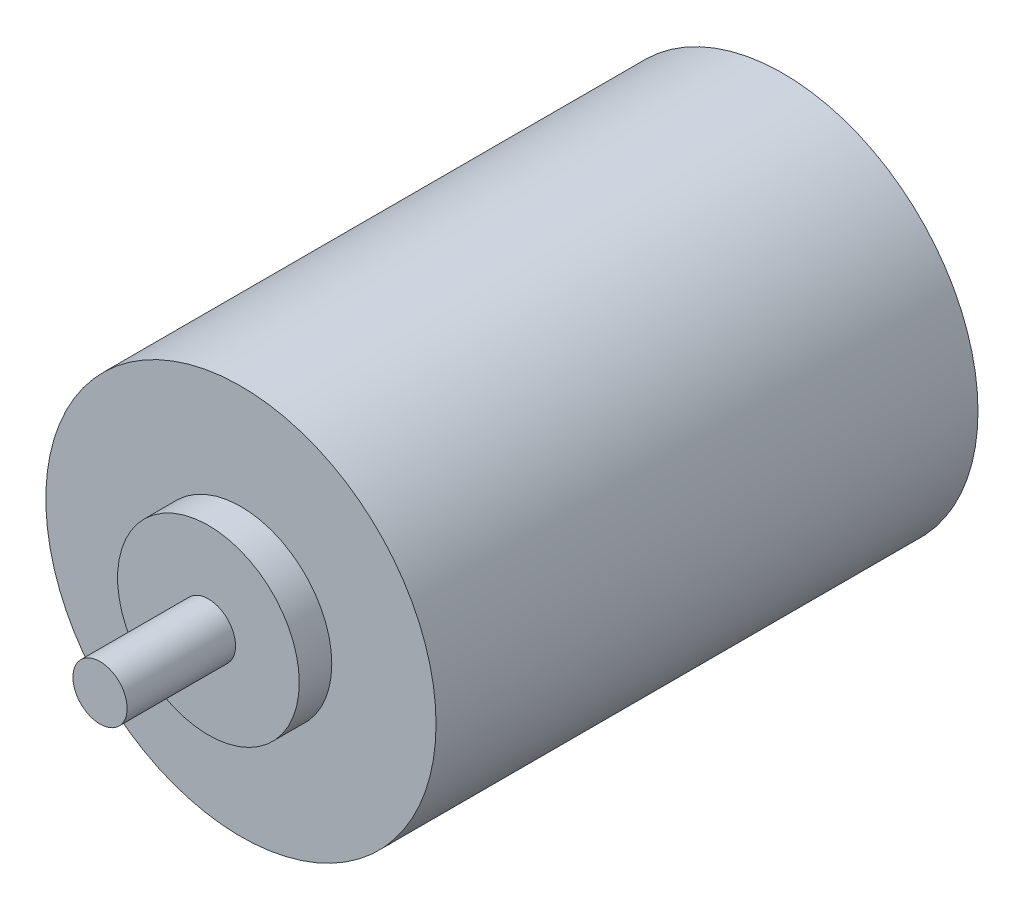
ISO-10303-21;
HEADER;
FILE_DESCRIPTION(('STEP AP214'),'2;1');
FILE_NAME('part.step','',(''),(''),'','','');
FILE_SCHEMA(('AUTOMOTIVE_DESIGN { 1 0 10303 214 1 1 1 1 }'));
ENDSEC;
DATA;
#1=APPLICATION_CONTEXT('core data for automotive mechanical design processes');
#2=APPLICATION_PROTOCOL_DEFINITION('international standard','automotive_design',2000,#1);
#3=PRODUCT_CONTEXT('',#1,'mechanical');
#4=PRODUCT('Part','Part','',(#3));
#5=PRODUCT_RELATED_PRODUCT_CATEGORY('part','',(#4));
#6=PRODUCT_DEFINITION_FORMATION('','',#4);
#7=PRODUCT_DEFINITION_CONTEXT('part definition',#1,'design');
#8=PRODUCT_DEFINITION('design','',#6,#7);
#9=PRODUCT_DEFINITION_SHAPE('','',#8);
#10=(LENGTH_UNIT() NAMED_UNIT(*) SI_UNIT(.MILLI.,.METRE.));
#11=(NAMED_UNIT(*) PLANE_ANGLE_UNIT() SI_UNIT($,.RADIAN.));
#12=(NAMED_UNIT(*) SI_UNIT($,.STERADIAN.) SOLID_ANGLE_UNIT());
#13=UNCERTAINTY_MEASURE_WITH_UNIT(LENGTH_MEASURE(1.E-05),#10,'distance_accuracy_value','');
#14=(GEOMETRIC_REPRESENTATION_CONTEXT(3) GLOBAL_UNCERTAINTY_ASSIGNED_CONTEXT((#13)) GLOBAL_UNIT_ASSIGNED_CONTEXT((#10,
#11,#12)) REPRESENTATION_CONTEXT('',''));
#15=CARTESIAN_POINT('',(0.,0.,0.));
#16=DIRECTION('',(0.,0.,1.));
#17=DIRECTION('',(1.,0.,0.));
#18=AXIS2_PLACEMENT_3D('',#15,#16,#17);
#19=CARTESIAN_POINT('',(0.,0.,50.));
#20=DIRECTION('',(0.,0.,-1.));
#21=DIRECTION('',(-1.,0.,0.));
#22=AXIS2_PLACEMENT_3D('',#19,#20,#21);
#23=CYLINDRICAL_SURFACE('',#22,18.);
#24=CARTESIAN_POINT('',(0.,0.,50.));
#25=DIRECTION('',(0.,0.,1.));
#26=DIRECTION('',(1.,0.,0.));
#27=AXIS2_PLACEMENT_3D('',#24,#25,#26);
#28=CIRCLE('',#27,18.);
#29=CARTESIAN_POINT('',(18.,0.,50.));
#30=VERTEX_POINT('',#29);
#31=EDGE_CURVE('E55',#30,#30,#28,.T.);
#32=ORIENTED_EDGE('',*,*,#31,.F.);
#33=EDGE_LOOP('',(#32));
#34=FACE_BOUND('',#33,.T.);
#35=CARTESIAN_POINT('',(0.,0.,0.));
#36=DIRECTION('',(0.,0.,1.));
#37=DIRECTION('',(1.,0.,0.));
#38=AXIS2_PLACEMENT_3D('',#35,#36,#37);
#39=CIRCLE('',#38,18.);
#40=CARTESIAN_POINT('',(18.,0.,0.));
#41=VERTEX_POINT('',#40);
#42=EDGE_CURVE('E44',#41,#41,#39,.T.);
#43=ORIENTED_EDGE('',*,*,#42,.T.);
#44=EDGE_LOOP('',(#43));
#45=FACE_BOUND('',#44,.T.);
#46=ADVANCED_FACE('F41',(#34,#45),#23,.T.);
#47=CARTESIAN_POINT('',(0.,0.,50.));
#48=DIRECTION('',(0.,0.,1.));
#49=DIRECTION('',(1.,0.,0.));
#50=AXIS2_PLACEMENT_3D('',#47,#48,#49);
#51=PLANE('',#50);
#52=CARTESIAN_POINT('',(0.,0.,50.));
#53=DIRECTION('',(0.,0.,1.));
#54=DIRECTION('',(1.,0.,0.));
#55=AXIS2_PLACEMENT_3D('',#52,#53,#54);
#56=CIRCLE('',#55,8.3807767872852);
#57=CARTESIAN_POINT('',(8.3807767872852,0.,50.));
#58=VERTEX_POINT('',#57);
#59=EDGE_CURVE('E49',#58,#58,#56,.T.);
#60=ORIENTED_EDGE('',*,*,#59,.F.);
#61=EDGE_LOOP('',(#60));
#62=FACE_BOUND('',#61,.T.);
#63=ORIENTED_EDGE('',*,*,#31,.T.);
#64=EDGE_LOOP('',(#63));
#65=FACE_BOUND('',#64,.T.);
#66=ADVANCED_FACE('F75',(#62,#65),#51,.T.);
#67=CARTESIAN_POINT('',(0.,0.,0.));
#68=DIRECTION('',(0.,0.,1.));
#69=DIRECTION('',(1.,0.,0.));
#70=AXIS2_PLACEMENT_3D('',#67,#68,#69);
#71=PLANE('',#70);
#72=ORIENTED_EDGE('',*,*,#42,.F.);
#73=EDGE_LOOP('',(#72));
#74=FACE_BOUND('',#73,.T.);
#75=ADVANCED_FACE('F72',(#74),#71,.F.);
#76=CARTESIAN_POINT('',(0.,0.,53.));
#77=DIRECTION('',(0.,0.,-1.));
#78=DIRECTION('',(-1.,0.,0.));
#79=AXIS2_PLACEMENT_3D('',#76,#77,#78);
#80=CYLINDRICAL_SURFACE('',#79,8.3807767872852);
#81=CARTESIAN_POINT('',(0.,0.,53.));
#82=DIRECTION('',(0.,0.,1.));
#83=DIRECTION('',(1.,0.,0.));
#84=AXIS2_PLACEMENT_3D('',#81,#82,#83);
#85=CIRCLE('',#84,8.3807767872852);
#86=CARTESIAN_POINT('',(8.3807767872852,0.,53.));
#87=VERTEX_POINT('',#86);
#88=EDGE_CURVE('E60',#87,#87,#85,.T.);
#89=ORIENTED_EDGE('',*,*,#88,.F.);
#90=EDGE_LOOP('',(#89));
#91=FACE_BOUND('',#90,.T.);
#92=ORIENTED_EDGE('',*,*,#59,.T.);
#93=EDGE_LOOP('',(#92));
#94=FACE_BOUND('',#93,.T.);
#95=ADVANCED_FACE('F74',(#91,#94),#80,.T.);
#96=CARTESIAN_POINT('',(0.,0.,53.));
#97=DIRECTION('',(0.,0.,1.));
#98=DIRECTION('',(1.,0.,0.));
#99=AXIS2_PLACEMENT_3D('',#96,#97,#98);
#100=PLANE('',#99);
#101=CARTESIAN_POINT('',(0.,0.,53.));
#102=DIRECTION('',(0.,0.,1.));
#103=DIRECTION('',(1.,0.,0.));
#104=AXIS2_PLACEMENT_3D('',#101,#102,#103);
#105=CIRCLE('',#104,2.5);
#106=CARTESIAN_POINT('',(2.5,0.,53.));
#107=VERTEX_POINT('',#106);
#108=EDGE_CURVE('E10',#107,#107,#105,.T.);
#109=ORIENTED_EDGE('',*,*,#108,.F.);
#110=EDGE_LOOP('',(#109));
#111=FACE_BOUND('',#110,.T.);
#112=ORIENTED_EDGE('',*,*,#88,.T.);
#113=EDGE_LOOP('',(#112));
#114=FACE_BOUND('',#113,.T.);
#115=ADVANCED_FACE('F80',(#111,#114),#100,.T.);
#116=CARTESIAN_POINT('',(0.,0.,63.));
#117=DIRECTION('',(0.,0.,-1.));
#118=DIRECTION('',(-1.,0.,0.));
#119=AXIS2_PLACEMENT_3D('',#116,#117,#118);
#120=CYLINDRICAL_SURFACE('',#119,2.5);
#121=CARTESIAN_POINT('',(0.,0.,63.));
#122=DIRECTION('',(0.,0.,1.));
#123=DIRECTION('',(1.,0.,0.));
#124=AXIS2_PLACEMENT_3D('',#121,#122,#123);
#125=CIRCLE('',#124,2.5);
#126=CARTESIAN_POINT('',(2.5,0.,63.));
#127=VERTEX_POINT('',#126);
#128=EDGE_CURVE('E59',#127,#127,#125,.T.);
#129=ORIENTED_EDGE('',*,*,#128,.F.);
#130=EDGE_LOOP('',(#129));
#131=FACE_BOUND('',#130,.T.);
#132=ORIENTED_EDGE('',*,*,#108,.T.);
#133=EDGE_LOOP('',(#132));
#134=FACE_BOUND('',#133,.T.);
#135=ADVANCED_FACE('F112',(#131,#134),#120,.T.);
#136=CARTESIAN_POINT('',(0.,0.,63.));
#137=DIRECTION('',(0.,0.,1.));
#138=DIRECTION('',(1.,0.,0.));
#139=AXIS2_PLACEMENT_3D('',#136,#137,#138);
#140=PLANE('',#139);
#141=ORIENTED_EDGE('',*,*,#128,.T.);
#142=EDGE_LOOP('',(#141));
#143=FACE_BOUND('',#142,.T.);
#144=ADVANCED_FACE('F120',(#143),#140,.T.);
#145=CLOSED_SHELL('',(#46,#66,#75,#95,#115,#135,#144));
#146=MANIFOLD_SOLID_BREP('B2',#145);
#147=ADVANCED_BREP_SHAPE_REPRESENTATION('',(#18,#146),#14);
#148=SHAPE_DEFINITION_REPRESENTATION(#9,#147);
ENDSEC;
END-ISO-10303-21;
